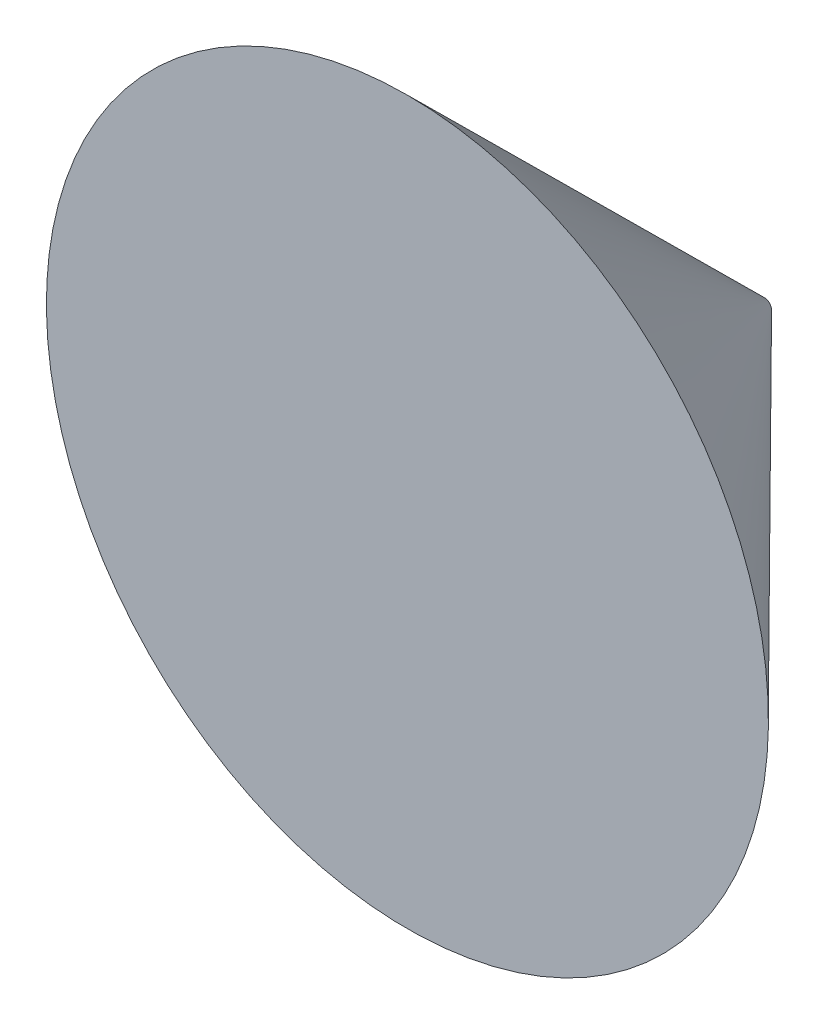
ISO-10303-21;
HEADER;
FILE_DESCRIPTION(('STEP AP214'),'2;1');
FILE_NAME('part.step','',(''),(''),'','','');
FILE_SCHEMA(('AUTOMOTIVE_DESIGN { 1 0 10303 214 1 1 1 1 }'));
ENDSEC;
DATA;
#1=APPLICATION_CONTEXT('core data for automotive mechanical design processes');
#2=APPLICATION_PROTOCOL_DEFINITION('international standard','automotive_design',2000,#1);
#3=PRODUCT_CONTEXT('',#1,'mechanical');
#4=PRODUCT('Part','Part','',(#3));
#5=PRODUCT_RELATED_PRODUCT_CATEGORY('part','',(#4));
#6=PRODUCT_DEFINITION_FORMATION('','',#4);
#7=PRODUCT_DEFINITION_CONTEXT('part definition',#1,'design');
#8=PRODUCT_DEFINITION('design','',#6,#7);
#9=PRODUCT_DEFINITION_SHAPE('','',#8);
#10=(LENGTH_UNIT() NAMED_UNIT(*) SI_UNIT(.MILLI.,.METRE.));
#11=(NAMED_UNIT(*) PLANE_ANGLE_UNIT() SI_UNIT($,.RADIAN.));
#12=(NAMED_UNIT(*) SI_UNIT($,.STERADIAN.) SOLID_ANGLE_UNIT());
#13=UNCERTAINTY_MEASURE_WITH_UNIT(LENGTH_MEASURE(1.E-05),#10,'distance_accuracy_value','');
#14=(GEOMETRIC_REPRESENTATION_CONTEXT(3) GLOBAL_UNCERTAINTY_ASSIGNED_CONTEXT((#13)) GLOBAL_UNIT_ASSIGNED_CONTEXT((#10,
#11,#12)) REPRESENTATION_CONTEXT('',''));
#15=CARTESIAN_POINT('',(0.,0.,0.));
#16=DIRECTION('',(0.,0.,1.));
#17=DIRECTION('',(1.,0.,0.));
#18=AXIS2_PLACEMENT_3D('',#15,#16,#17);
#19=CARTESIAN_POINT('',(0.,4.,0.));
#20=DIRECTION('',(0.,0.,-1.));
#21=DIRECTION('',(0.,1.,0.));
#22=AXIS2_PLACEMENT_3D('',#19,#20,#21);
#23=PLANE('',#22);
#24=CARTESIAN_POINT('',(0.,0.,0.));
#25=DIRECTION('',(0.,0.,-1.));
#26=DIRECTION('',(0.,1.,0.));
#27=AXIS2_PLACEMENT_3D('',#24,#25,#26);
#28=CIRCLE('',#27,4.);
#29=CARTESIAN_POINT('',(0.,4.,0.));
#30=VERTEX_POINT('',#29);
#31=EDGE_CURVE('E56',#30,#30,#28,.T.);
#32=ORIENTED_EDGE('',*,*,#31,.T.);
#33=EDGE_LOOP('',(#32));
#34=FACE_BOUND('',#33,.T.);
#35=ADVANCED_FACE('F49',(#34),#23,.T.);
#36=CARTESIAN_POINT('',(0.,0.,196.));
#37=DIRECTION('',(0.,0.,1.));
#38=DIRECTION('',(0.,-1.,0.));
#39=AXIS2_PLACEMENT_3D('',#36,#37,#38);
#40=PLANE('',#39);
#41=CARTESIAN_POINT('',(0.,0.,196.));
#42=DIRECTION('',(0.,0.,-1.));
#43=DIRECTION('',(0.,1.,0.));
#44=AXIS2_PLACEMENT_3D('',#41,#42,#43);
#45=CIRCLE('',#44,198.296997276613);
#46=CARTESIAN_POINT('',(0.,198.296997276613,196.));
#47=VERTEX_POINT('',#46);
#48=EDGE_CURVE('E10',#47,#47,#45,.T.);
#49=ORIENTED_EDGE('',*,*,#48,.F.);
#50=EDGE_LOOP('',(#49));
#51=FACE_BOUND('',#50,.T.);
#52=ADVANCED_FACE('F68',(#51),#40,.T.);
#53=CARTESIAN_POINT('',(0.,0.,0.));
#54=DIRECTION('',(0.,0.,1.));
#55=DIRECTION('',(0.,-1.,0.));
#56=AXIS2_PLACEMENT_3D('',#53,#54,#55);
#57=CONICAL_SURFACE('',#56,4.,0.781034840267457);
#58=ORIENTED_EDGE('',*,*,#48,.T.);
#59=EDGE_LOOP('',(#58));
#60=FACE_BOUND('',#59,.T.);
#61=ORIENTED_EDGE('',*,*,#31,.F.);
#62=EDGE_LOOP('',(#61));
#63=FACE_BOUND('',#62,.T.);
#64=ADVANCED_FACE('F66',(#60,#63),#57,.T.);
#65=CLOSED_SHELL('',(#35,#52,#64));
#66=MANIFOLD_SOLID_BREP('B2',#65);
#67=ADVANCED_BREP_SHAPE_REPRESENTATION('',(#18,#66),#14);
#68=SHAPE_DEFINITION_REPRESENTATION(#9,#67);
ENDSEC;
END-ISO-10303-21;
